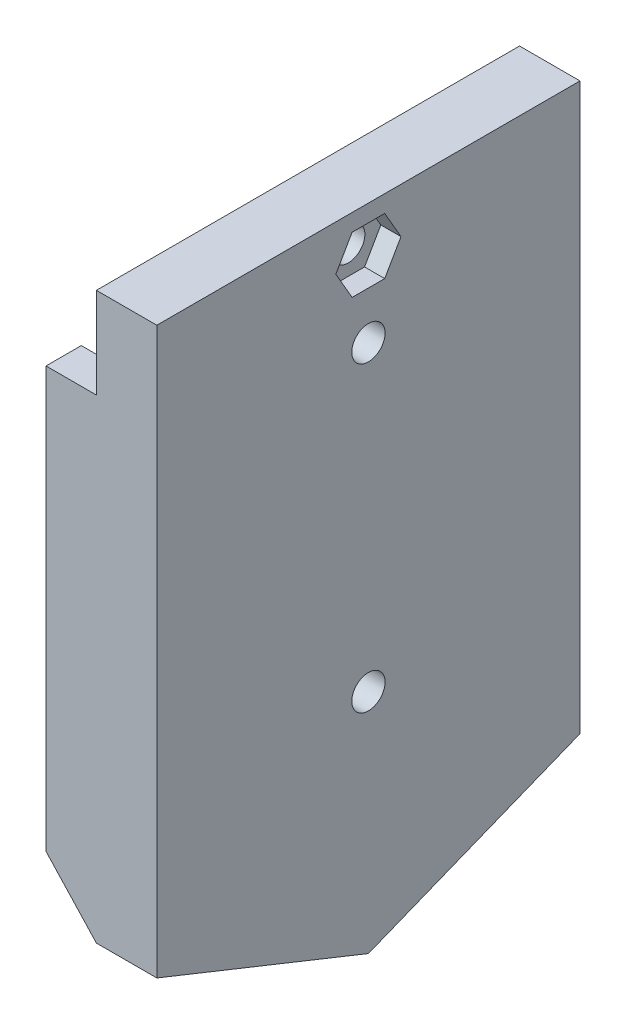
ISO-10303-21;
HEADER;
FILE_DESCRIPTION(('STEP AP214'),'2;1');
FILE_NAME('part.step','',(''),(''),'','','');
FILE_SCHEMA(('AUTOMOTIVE_DESIGN { 1 0 10303 214 1 1 1 1 }'));
ENDSEC;
DATA;
#1=APPLICATION_CONTEXT('core data for automotive mechanical design processes');
#2=APPLICATION_PROTOCOL_DEFINITION('international standard','automotive_design',2000,#1);
#3=PRODUCT_CONTEXT('',#1,'mechanical');
#4=PRODUCT('Part','Part','',(#3));
#5=PRODUCT_RELATED_PRODUCT_CATEGORY('part','',(#4));
#6=PRODUCT_DEFINITION_FORMATION('','',#4);
#7=PRODUCT_DEFINITION_CONTEXT('part definition',#1,'design');
#8=PRODUCT_DEFINITION('design','',#6,#7);
#9=PRODUCT_DEFINITION_SHAPE('','',#8);
#10=(LENGTH_UNIT() NAMED_UNIT(*) SI_UNIT(.MILLI.,.METRE.));
#11=(NAMED_UNIT(*) PLANE_ANGLE_UNIT() SI_UNIT($,.RADIAN.));
#12=(NAMED_UNIT(*) SI_UNIT($,.STERADIAN.) SOLID_ANGLE_UNIT());
#13=UNCERTAINTY_MEASURE_WITH_UNIT(LENGTH_MEASURE(1.E-05),#10,'distance_accuracy_value','');
#14=(GEOMETRIC_REPRESENTATION_CONTEXT(3) GLOBAL_UNCERTAINTY_ASSIGNED_CONTEXT((#13)) GLOBAL_UNIT_ASSIGNED_CONTEXT((#10,
#11,#12)) REPRESENTATION_CONTEXT('',''));
#15=CARTESIAN_POINT('',(0.,0.,0.));
#16=DIRECTION('',(0.,0.,1.));
#17=DIRECTION('',(1.,0.,0.));
#18=AXIS2_PLACEMENT_3D('',#15,#16,#17);
#19=CARTESIAN_POINT('',(6.00000000000001,-9.5,0.));
#20=DIRECTION('',(-1.,0.,0.));
#21=DIRECTION('',(0.,0.,1.));
#22=AXIS2_PLACEMENT_3D('',#19,#20,#21);
#23=CYLINDRICAL_SURFACE('',#22,1.65);
#24=CARTESIAN_POINT('',(6.00000000000001,-9.5,0.));
#25=DIRECTION('',(-1.,0.,0.));
#26=DIRECTION('',(0.,0.,1.));
#27=AXIS2_PLACEMENT_3D('',#24,#25,#26);
#28=CIRCLE('',#27,1.65);
#29=CARTESIAN_POINT('',(6.00000000000001,-9.5,1.65));
#30=VERTEX_POINT('',#29);
#31=EDGE_CURVE('E265',#30,#30,#28,.T.);
#32=ORIENTED_EDGE('',*,*,#31,.F.);
#33=EDGE_LOOP('',(#32));
#34=FACE_BOUND('',#33,.T.);
#35=CARTESIAN_POINT('',(2.5,-9.5,0.));
#36=DIRECTION('',(-1.,0.,0.));
#37=DIRECTION('',(0.,0.,1.));
#38=AXIS2_PLACEMENT_3D('',#35,#36,#37);
#39=CIRCLE('',#38,1.65);
#40=CARTESIAN_POINT('',(2.5,-9.5,1.65));
#41=VERTEX_POINT('',#40);
#42=EDGE_CURVE('E39',#41,#41,#39,.F.);
#43=ORIENTED_EDGE('',*,*,#42,.F.);
#44=EDGE_LOOP('',(#43));
#45=FACE_BOUND('',#44,.T.);
#46=ADVANCED_FACE('F35',(#34,#45),#23,.F.);
#47=CARTESIAN_POINT('',(6.00000000000001,20.5,0.));
#48=DIRECTION('',(-1.,0.,0.));
#49=DIRECTION('',(0.,0.,1.));
#50=AXIS2_PLACEMENT_3D('',#47,#48,#49);
#51=CYLINDRICAL_SURFACE('',#50,1.65);
#52=CARTESIAN_POINT('',(6.00000000000001,20.5,0.));
#53=DIRECTION('',(-1.,0.,0.));
#54=DIRECTION('',(0.,0.,1.));
#55=AXIS2_PLACEMENT_3D('',#52,#53,#54);
#56=CIRCLE('',#55,1.65);
#57=CARTESIAN_POINT('',(6.00000000000001,20.5,1.65));
#58=VERTEX_POINT('',#57);
#59=EDGE_CURVE('E328',#58,#58,#56,.T.);
#60=ORIENTED_EDGE('',*,*,#59,.F.);
#61=EDGE_LOOP('',(#60));
#62=FACE_BOUND('',#61,.T.);
#63=CARTESIAN_POINT('',(2.5,20.5,0.));
#64=DIRECTION('',(-1.,0.,0.));
#65=DIRECTION('',(0.,0.,1.));
#66=AXIS2_PLACEMENT_3D('',#63,#64,#65);
#67=CIRCLE('',#66,1.65);
#68=CARTESIAN_POINT('',(2.5,20.5,1.65));
#69=VERTEX_POINT('',#68);
#70=EDGE_CURVE('E267',#69,#69,#67,.F.);
#71=ORIENTED_EDGE('',*,*,#70,.F.);
#72=EDGE_LOOP('',(#71));
#73=FACE_BOUND('',#72,.T.);
#74=ADVANCED_FACE('F439',(#62,#73),#51,.F.);
#75=CARTESIAN_POINT('',(6.00000000000001,28.,0.));
#76=DIRECTION('',(-1.,0.,0.));
#77=DIRECTION('',(0.,0.,1.));
#78=AXIS2_PLACEMENT_3D('',#75,#76,#77);
#79=CYLINDRICAL_SURFACE('',#78,1.65);
#80=CARTESIAN_POINT('',(0.,28.,0.));
#81=DIRECTION('',(1.,0.,0.));
#82=DIRECTION('',(0.,0.,-1.));
#83=AXIS2_PLACEMENT_3D('',#80,#81,#82);
#84=CIRCLE('',#83,1.65);
#85=CARTESIAN_POINT('',(0.,28.,-1.65));
#86=VERTEX_POINT('',#85);
#87=EDGE_CURVE('E262',#86,#86,#84,.T.);
#88=ORIENTED_EDGE('',*,*,#87,.F.);
#89=EDGE_LOOP('',(#88));
#90=FACE_BOUND('',#89,.T.);
#91=CARTESIAN_POINT('',(4.00000000000001,28.,0.));
#92=DIRECTION('',(1.,0.,0.));
#93=DIRECTION('',(0.,0.,-1.));
#94=AXIS2_PLACEMENT_3D('',#91,#92,#93);
#95=CIRCLE('',#94,1.65);
#96=CARTESIAN_POINT('',(4.00000000000001,28.,-1.65));
#97=VERTEX_POINT('',#96);
#98=EDGE_CURVE('E263',#97,#97,#95,.F.);
#99=ORIENTED_EDGE('',*,*,#98,.F.);
#100=EDGE_LOOP('',(#99));
#101=FACE_BOUND('',#100,.T.);
#102=ADVANCED_FACE('F445',(#90,#101),#79,.F.);
#103=CARTESIAN_POINT('',(-5.,-16.5,0.));
#104=DIRECTION('',(0.,-0.928476690885259,0.371390676354104));
#105=DIRECTION('',(0.,-0.371390676354104,-0.928476690885259));
#106=AXIS2_PLACEMENT_3D('',#103,#104,#105);
#107=PLANE('',#106);
#108=DIRECTION('',(0.,0.371390676354104,0.928476690885259));
#109=VECTOR('',#108,1.);
#110=CARTESIAN_POINT('',(-4.,-16.5,0.));
#111=LINE('',#110,#109);
#112=CARTESIAN_POINT('',(-4.,-16.5,0.));
#113=VERTEX_POINT('',#112);
#114=CARTESIAN_POINT('',(-4.,-9.5,17.5));
#115=VERTEX_POINT('',#114);
#116=EDGE_CURVE('E337',#113,#115,#111,.T.);
#117=ORIENTED_EDGE('',*,*,#116,.F.);
#118=DIRECTION('',(1.,0.,0.));
#119=VECTOR('',#118,1.);
#120=CARTESIAN_POINT('',(-5.,-16.5,0.));
#121=LINE('',#120,#119);
#122=CARTESIAN_POINT('',(-5.,-16.5,0.));
#123=VERTEX_POINT('',#122);
#124=EDGE_CURVE('E224',#123,#113,#121,.T.);
#125=ORIENTED_EDGE('',*,*,#124,.F.);
#126=DIRECTION('',(0.,-0.371390676354104,-0.928476690885259));
#127=VECTOR('',#126,1.);
#128=CARTESIAN_POINT('',(-5.,-16.5,0.));
#129=LINE('',#128,#127);
#130=CARTESIAN_POINT('',(-5.,-9.5,17.5));
#131=VERTEX_POINT('',#130);
#132=EDGE_CURVE('E343',#131,#123,#129,.T.);
#133=ORIENTED_EDGE('',*,*,#132,.F.);
#134=DIRECTION('',(1.,0.,0.));
#135=VECTOR('',#134,1.);
#136=CARTESIAN_POINT('',(-5.,-9.5,17.5));
#137=LINE('',#136,#135);
#138=EDGE_CURVE('E360',#131,#115,#137,.T.);
#139=ORIENTED_EDGE('',*,*,#138,.T.);
#140=EDGE_LOOP('',(#117,#125,#133,#139));
#141=FACE_BOUND('',#140,.T.);
#142=ADVANCED_FACE('F453',(#141),#107,.F.);
#143=CARTESIAN_POINT('',(-5.,-9.5,-17.5));
#144=DIRECTION('',(0.,-0.928476690885259,-0.371390676354104));
#145=DIRECTION('',(0.,0.371390676354104,-0.928476690885259));
#146=AXIS2_PLACEMENT_3D('',#143,#144,#145);
#147=PLANE('',#146);
#148=DIRECTION('',(0.,-0.371390676354104,0.928476690885259));
#149=VECTOR('',#148,1.);
#150=CARTESIAN_POINT('',(-4.,-9.5,-17.5));
#151=LINE('',#150,#149);
#152=CARTESIAN_POINT('',(-4.,-9.5,-17.5));
#153=VERTEX_POINT('',#152);
#154=EDGE_CURVE('E230',#153,#113,#151,.T.);
#155=ORIENTED_EDGE('',*,*,#154,.F.);
#156=DIRECTION('',(1.,0.,0.));
#157=VECTOR('',#156,1.);
#158=CARTESIAN_POINT('',(-5.,-9.5,-17.5));
#159=LINE('',#158,#157);
#160=CARTESIAN_POINT('',(-5.,-9.5,-17.5));
#161=VERTEX_POINT('',#160);
#162=EDGE_CURVE('E384',#161,#153,#159,.T.);
#163=ORIENTED_EDGE('',*,*,#162,.F.);
#164=DIRECTION('',(0.,0.371390676354104,-0.928476690885259));
#165=VECTOR('',#164,1.);
#166=CARTESIAN_POINT('',(-5.,-9.5,-17.5));
#167=LINE('',#166,#165);
#168=EDGE_CURVE('E346',#123,#161,#167,.T.);
#169=ORIENTED_EDGE('',*,*,#168,.F.);
#170=ORIENTED_EDGE('',*,*,#124,.T.);
#171=EDGE_LOOP('',(#155,#163,#169,#170));
#172=FACE_BOUND('',#171,.T.);
#173=ADVANCED_FACE('F474',(#172),#147,.F.);
#174=CARTESIAN_POINT('',(0.,32.5,21.));
#175=DIRECTION('',(1.,0.,0.));
#176=DIRECTION('',(0.,0.,-1.));
#177=AXIS2_PLACEMENT_3D('',#174,#175,#176);
#178=PLANE('',#177);
#179=CARTESIAN_POINT('',(0.,-9.5,0.));
#180=DIRECTION('',(-1.,0.,0.));
#181=DIRECTION('',(0.,0.,1.));
#182=AXIS2_PLACEMENT_3D('',#179,#180,#181);
#183=CIRCLE('',#182,3.5);
#184=CARTESIAN_POINT('',(0.,-9.5,3.5));
#185=VERTEX_POINT('',#184);
#186=EDGE_CURVE('E282',#185,#185,#183,.T.);
#187=ORIENTED_EDGE('',*,*,#186,.F.);
#188=EDGE_LOOP('',(#187));
#189=FACE_BOUND('',#188,.T.);
#190=CARTESIAN_POINT('',(0.,20.5,0.));
#191=DIRECTION('',(-1.,0.,0.));
#192=DIRECTION('',(0.,0.,1.));
#193=AXIS2_PLACEMENT_3D('',#190,#191,#192);
#194=CIRCLE('',#193,3.5);
#195=CARTESIAN_POINT('',(0.,20.5,3.5));
#196=VERTEX_POINT('',#195);
#197=EDGE_CURVE('E275',#196,#196,#194,.T.);
#198=ORIENTED_EDGE('',*,*,#197,.F.);
#199=EDGE_LOOP('',(#198));
#200=FACE_BOUND('',#199,.T.);
#201=ORIENTED_EDGE('',*,*,#87,.T.);
#202=EDGE_LOOP('',(#201));
#203=FACE_BOUND('',#202,.T.);
#204=DIRECTION('',(0.,1.,0.));
#205=VECTOR('',#204,1.);
#206=CARTESIAN_POINT('',(0.,23.5,-17.5));
#207=LINE('',#206,#205);
#208=CARTESIAN_POINT('',(0.,-13.9151208925754,-17.5));
#209=VERTEX_POINT('',#208);
#210=CARTESIAN_POINT('',(0.,23.5,-17.5));
#211=VERTEX_POINT('',#210);
#212=EDGE_CURVE('E342',#209,#211,#207,.T.);
#213=ORIENTED_EDGE('',*,*,#212,.F.);
#214=DIRECTION('',(0.,-0.371390676354104,0.928476690885259));
#215=VECTOR('',#214,1.);
#216=CARTESIAN_POINT('',(0.,-21.2716559418753,0.891337623249878));
#217=LINE('',#216,#215);
#218=CARTESIAN_POINT('',(0.,-20.9151208925754,0.));
#219=VERTEX_POINT('',#218);
#220=EDGE_CURVE('E234',#209,#219,#217,.T.);
#221=ORIENTED_EDGE('',*,*,#220,.T.);
#222=DIRECTION('',(0.,0.371390676354104,0.92847669088526));
#223=VECTOR('',#222,1.);
#224=CARTESIAN_POINT('',(0.,-14.2716559418753,16.6086623767501));
#225=LINE('',#224,#223);
#226=CARTESIAN_POINT('',(0.,-13.9151208925754,17.5));
#227=VERTEX_POINT('',#226);
#228=EDGE_CURVE('E232',#219,#227,#225,.T.);
#229=ORIENTED_EDGE('',*,*,#228,.T.);
#230=DIRECTION('',(0.,-1.,0.));
#231=VECTOR('',#230,1.);
#232=CARTESIAN_POINT('',(0.,23.5,17.5));
#233=LINE('',#232,#231);
#234=CARTESIAN_POINT('',(0.,23.5,17.5));
#235=VERTEX_POINT('',#234);
#236=EDGE_CURVE('E347',#235,#227,#233,.T.);
#237=ORIENTED_EDGE('',*,*,#236,.F.);
#238=DIRECTION('',(0.,0.,-1.));
#239=VECTOR('',#238,1.);
#240=CARTESIAN_POINT('',(0.,23.5,17.5));
#241=LINE('',#240,#239);
#242=CARTESIAN_POINT('',(0.,23.5,21.));
#243=VERTEX_POINT('',#242);
#244=EDGE_CURVE('E365',#243,#235,#241,.T.);
#245=ORIENTED_EDGE('',*,*,#244,.F.);
#246=DIRECTION('',(0.,-1.,0.));
#247=VECTOR('',#246,1.);
#248=CARTESIAN_POINT('',(0.,32.5,21.));
#249=LINE('',#248,#247);
#250=CARTESIAN_POINT('',(0.,32.5,21.));
#251=VERTEX_POINT('',#250);
#252=EDGE_CURVE('E211',#251,#243,#249,.T.);
#253=ORIENTED_EDGE('',*,*,#252,.F.);
#254=DIRECTION('',(0.,0.,-1.));
#255=VECTOR('',#254,1.);
#256=CARTESIAN_POINT('',(0.,32.5,21.));
#257=LINE('',#256,#255);
#258=CARTESIAN_POINT('',(0.,32.5,-21.));
#259=VERTEX_POINT('',#258);
#260=EDGE_CURVE('E213',#251,#259,#257,.T.);
#261=ORIENTED_EDGE('',*,*,#260,.T.);
#262=DIRECTION('',(0.,-1.,0.));
#263=VECTOR('',#262,1.);
#264=CARTESIAN_POINT('',(0.,32.5,-21.));
#265=LINE('',#264,#263);
#266=CARTESIAN_POINT('',(0.,23.5,-21.));
#267=VERTEX_POINT('',#266);
#268=EDGE_CURVE('E223',#259,#267,#265,.T.);
#269=ORIENTED_EDGE('',*,*,#268,.T.);
#270=DIRECTION('',(0.,0.,-1.));
#271=VECTOR('',#270,1.);
#272=CARTESIAN_POINT('',(0.,23.5,-21.));
#273=LINE('',#272,#271);
#274=EDGE_CURVE('E362',#211,#267,#273,.T.);
#275=ORIENTED_EDGE('',*,*,#274,.F.);
#276=EDGE_LOOP('',(#213,#221,#229,#237,#245,#253,#261,#269,#275));
#277=FACE_BOUND('',#276,.T.);
#278=ADVANCED_FACE('F394',(#189,#200,#203,#277),#178,.F.);
#279=CARTESIAN_POINT('',(6.00000000000001,32.5,21.));
#280=DIRECTION('',(0.,-1.,0.));
#281=DIRECTION('',(0.,0.,-1.));
#282=AXIS2_PLACEMENT_3D('',#279,#280,#281);
#283=PLANE('',#282);
#284=DIRECTION('',(-1.,0.,0.));
#285=VECTOR('',#284,1.);
#286=CARTESIAN_POINT('',(6.00000000000001,32.5,-21.));
#287=LINE('',#286,#285);
#288=CARTESIAN_POINT('',(6.00000000000001,32.5,-21.));
#289=VERTEX_POINT('',#288);
#290=EDGE_CURVE('E220',#289,#259,#287,.T.);
#291=ORIENTED_EDGE('',*,*,#290,.T.);
#292=ORIENTED_EDGE('',*,*,#260,.F.);
#293=DIRECTION('',(-1.,0.,0.));
#294=VECTOR('',#293,1.);
#295=CARTESIAN_POINT('',(6.00000000000001,32.5,21.));
#296=LINE('',#295,#294);
#297=CARTESIAN_POINT('',(6.00000000000001,32.5,21.));
#298=VERTEX_POINT('',#297);
#299=EDGE_CURVE('E216',#298,#251,#296,.T.);
#300=ORIENTED_EDGE('',*,*,#299,.F.);
#301=DIRECTION('',(0.,0.,-1.));
#302=VECTOR('',#301,1.);
#303=CARTESIAN_POINT('',(6.00000000000001,32.5,21.));
#304=LINE('',#303,#302);
#305=EDGE_CURVE('E209',#298,#289,#304,.T.);
#306=ORIENTED_EDGE('',*,*,#305,.T.);
#307=EDGE_LOOP('',(#291,#292,#300,#306));
#308=FACE_BOUND('',#307,.T.);
#309=ADVANCED_FACE('F390',(#308),#283,.F.);
#310=CARTESIAN_POINT('',(6.00000000000001,-32.5,21.));
#311=DIRECTION('',(-1.,0.,0.));
#312=DIRECTION('',(0.,0.,1.));
#313=AXIS2_PLACEMENT_3D('',#310,#311,#312);
#314=PLANE('',#313);
#315=DIRECTION('',(0.,0.866025403784438,0.500000000000001));
#316=VECTOR('',#315,1.);
#317=CARTESIAN_POINT('',(6.00000000000001,28.,-3.2331615074619));
#318=LINE('',#317,#316);
#319=CARTESIAN_POINT('',(6.00000000000001,28.,-3.23316150746191));
#320=VERTEX_POINT('',#319);
#321=CARTESIAN_POINT('',(6.00000000000001,30.8,-1.61658075373095));
#322=VERTEX_POINT('',#321);
#323=EDGE_CURVE('E272',#320,#322,#318,.T.);
#324=ORIENTED_EDGE('',*,*,#323,.F.);
#325=DIRECTION('',(0.,0.866025403784439,-0.499999999999999));
#326=VECTOR('',#325,1.);
#327=CARTESIAN_POINT('',(6.00000000000001,25.2,-1.61658075373095));
#328=LINE('',#327,#326);
#329=CARTESIAN_POINT('',(6.00000000000001,25.2,-1.61658075373095));
#330=VERTEX_POINT('',#329);
#331=EDGE_CURVE('E52',#330,#320,#328,.T.);
#332=ORIENTED_EDGE('',*,*,#331,.F.);
#333=DIRECTION('',(0.,0.,-1.));
#334=VECTOR('',#333,1.);
#335=CARTESIAN_POINT('',(6.00000000000001,25.2,1.61658075373095));
#336=LINE('',#335,#334);
#337=CARTESIAN_POINT('',(6.00000000000001,25.2,1.61658075373095));
#338=VERTEX_POINT('',#337);
#339=EDGE_CURVE('E289',#338,#330,#336,.T.);
#340=ORIENTED_EDGE('',*,*,#339,.F.);
#341=DIRECTION('',(0.,-0.866025403784439,-0.5));
#342=VECTOR('',#341,1.);
#343=CARTESIAN_POINT('',(6.00000000000001,28.,3.23316150746191));
#344=LINE('',#343,#342);
#345=CARTESIAN_POINT('',(6.00000000000001,28.,3.23316150746191));
#346=VERTEX_POINT('',#345);
#347=EDGE_CURVE('E313',#346,#338,#344,.T.);
#348=ORIENTED_EDGE('',*,*,#347,.F.);
#349=DIRECTION('',(0.,-0.866025403784439,0.5));
#350=VECTOR('',#349,1.);
#351=CARTESIAN_POINT('',(6.00000000000001,30.8,1.61658075373095));
#352=LINE('',#351,#350);
#353=CARTESIAN_POINT('',(6.00000000000001,30.8,1.61658075373095));
#354=VERTEX_POINT('',#353);
#355=EDGE_CURVE('E310',#354,#346,#352,.T.);
#356=ORIENTED_EDGE('',*,*,#355,.F.);
#357=DIRECTION('',(0.,0.,1.));
#358=VECTOR('',#357,1.);
#359=CARTESIAN_POINT('',(6.00000000000001,30.8,-1.61658075373095));
#360=LINE('',#359,#358);
#361=EDGE_CURVE('E307',#322,#354,#360,.T.);
#362=ORIENTED_EDGE('',*,*,#361,.F.);
#363=EDGE_LOOP('',(#324,#332,#340,#348,#356,#362));
#364=FACE_BOUND('',#363,.T.);
#365=ORIENTED_EDGE('',*,*,#59,.T.);
#366=EDGE_LOOP('',(#365));
#367=FACE_BOUND('',#366,.T.);
#368=ORIENTED_EDGE('',*,*,#31,.T.);
#369=EDGE_LOOP('',(#368));
#370=FACE_BOUND('',#369,.T.);
#371=DIRECTION('',(0.,-0.371390676354104,-0.928476690885259));
#372=VECTOR('',#371,1.);
#373=CARTESIAN_POINT('',(6.00000000000001,-23.6092746445474,21.));
#374=LINE('',#373,#372);
#375=CARTESIAN_POINT('',(6.00000000000001,-23.6092746445474,21.));
#376=VERTEX_POINT('',#375);
#377=CARTESIAN_POINT('',(6.00000000000001,-32.0092746445474,0.));
#378=VERTEX_POINT('',#377);
#379=EDGE_CURVE('E188',#376,#378,#374,.T.);
#380=ORIENTED_EDGE('',*,*,#379,.T.);
#381=DIRECTION('',(0.,0.371390676354103,-0.928476690885259));
#382=VECTOR('',#381,1.);
#383=CARTESIAN_POINT('',(6.00000000000001,-32.0092746445474,0.));
#384=LINE('',#383,#382);
#385=CARTESIAN_POINT('',(6.00000000000001,-23.6092746445474,-21.));
#386=VERTEX_POINT('',#385);
#387=EDGE_CURVE('E198',#378,#386,#384,.T.);
#388=ORIENTED_EDGE('',*,*,#387,.T.);
#389=DIRECTION('',(0.,1.,0.));
#390=VECTOR('',#389,1.);
#391=CARTESIAN_POINT('',(6.00000000000001,-32.5,-21.));
#392=LINE('',#391,#390);
#393=EDGE_CURVE('E226',#386,#289,#392,.T.);
#394=ORIENTED_EDGE('',*,*,#393,.T.);
#395=ORIENTED_EDGE('',*,*,#305,.F.);
#396=DIRECTION('',(0.,1.,0.));
#397=VECTOR('',#396,1.);
#398=CARTESIAN_POINT('',(6.00000000000001,-32.5,21.));
#399=LINE('',#398,#397);
#400=EDGE_CURVE('E202',#376,#298,#399,.T.);
#401=ORIENTED_EDGE('',*,*,#400,.F.);
#402=EDGE_LOOP('',(#380,#388,#394,#395,#401));
#403=FACE_BOUND('',#402,.T.);
#404=ADVANCED_FACE('F207',(#364,#367,#370,#403),#314,.F.);
#405=CARTESIAN_POINT('',(0.,0.,21.));
#406=DIRECTION('',(0.,0.,1.));
#407=DIRECTION('',(1.,0.,0.));
#408=AXIS2_PLACEMENT_3D('',#405,#406,#407);
#409=PLANE('',#408);
#410=DIRECTION('',(-1.,0.,0.));
#411=VECTOR('',#410,1.);
#412=CARTESIAN_POINT('',(6.00000000000001,-23.6092746445474,21.));
#413=LINE('',#412,#411);
#414=CARTESIAN_POINT('',(0.,-23.6092746445474,21.));
#415=VERTEX_POINT('',#414);
#416=EDGE_CURVE('E191',#376,#415,#413,.T.);
#417=ORIENTED_EDGE('',*,*,#416,.F.);
#418=ORIENTED_EDGE('',*,*,#400,.T.);
#419=ORIENTED_EDGE('',*,*,#299,.T.);
#420=ORIENTED_EDGE('',*,*,#252,.T.);
#421=DIRECTION('',(1.,0.,0.));
#422=VECTOR('',#421,1.);
#423=CARTESIAN_POINT('',(-5.,23.5,21.));
#424=LINE('',#423,#422);
#425=CARTESIAN_POINT('',(-5.,23.5,21.));
#426=VERTEX_POINT('',#425);
#427=EDGE_CURVE('E375',#426,#243,#424,.T.);
#428=ORIENTED_EDGE('',*,*,#427,.F.);
#429=DIRECTION('',(0.,1.,0.));
#430=VECTOR('',#429,1.);
#431=CARTESIAN_POINT('',(-5.,23.5,21.));
#432=LINE('',#431,#430);
#433=CARTESIAN_POINT('',(-5.,-18.224109837413,21.));
#434=VERTEX_POINT('',#433);
#435=EDGE_CURVE('E60',#434,#426,#432,.T.);
#436=ORIENTED_EDGE('',*,*,#435,.F.);
#437=DIRECTION('',(-0.680413817439775,0.732828108792937,0.));
#438=VECTOR('',#437,1.);
#439=CARTESIAN_POINT('',(-6.4000000000001,-16.7162636914152,21.));
#440=LINE('',#439,#438);
#441=EDGE_CURVE('E11',#434,#415,#440,.F.);
#442=ORIENTED_EDGE('',*,*,#441,.T.);
#443=EDGE_LOOP('',(#417,#418,#419,#420,#428,#436,#442));
#444=FACE_BOUND('',#443,.T.);
#445=ADVANCED_FACE('F200',(#444),#409,.T.);
#446=CARTESIAN_POINT('',(0.,0.,-21.));
#447=DIRECTION('',(0.,0.,1.));
#448=DIRECTION('',(1.,0.,0.));
#449=AXIS2_PLACEMENT_3D('',#446,#447,#448);
#450=PLANE('',#449);
#451=ORIENTED_EDGE('',*,*,#393,.F.);
#452=DIRECTION('',(-1.,0.,0.));
#453=VECTOR('',#452,1.);
#454=CARTESIAN_POINT('',(6.00000000000001,-23.6092746445474,-21.));
#455=LINE('',#454,#453);
#456=CARTESIAN_POINT('',(0.,-23.6092746445474,-21.));
#457=VERTEX_POINT('',#456);
#458=EDGE_CURVE('E417',#386,#457,#455,.T.);
#459=ORIENTED_EDGE('',*,*,#458,.T.);
#460=DIRECTION('',(0.680413817439775,-0.732828108792936,0.));
#461=VECTOR('',#460,1.);
#462=CARTESIAN_POINT('',(-11.7722069386842,-10.9302197428461,-21.));
#463=LINE('',#462,#461);
#464=CARTESIAN_POINT('',(-5.,-18.224109837413,-21.));
#465=VERTEX_POINT('',#464);
#466=EDGE_CURVE('E256',#457,#465,#463,.F.);
#467=ORIENTED_EDGE('',*,*,#466,.T.);
#468=DIRECTION('',(0.,-1.,0.));
#469=VECTOR('',#468,1.);
#470=CARTESIAN_POINT('',(-5.,-16.7162636914152,-21.));
#471=LINE('',#470,#469);
#472=CARTESIAN_POINT('',(-5.,23.5,-21.));
#473=VERTEX_POINT('',#472);
#474=EDGE_CURVE('E353',#473,#465,#471,.T.);
#475=ORIENTED_EDGE('',*,*,#474,.F.);
#476=DIRECTION('',(1.,0.,0.));
#477=VECTOR('',#476,1.);
#478=CARTESIAN_POINT('',(-5.,23.5,-21.));
#479=LINE('',#478,#477);
#480=EDGE_CURVE('E378',#473,#267,#479,.T.);
#481=ORIENTED_EDGE('',*,*,#480,.T.);
#482=ORIENTED_EDGE('',*,*,#268,.F.);
#483=ORIENTED_EDGE('',*,*,#290,.F.);
#484=EDGE_LOOP('',(#451,#459,#467,#475,#481,#482,#483));
#485=FACE_BOUND('',#484,.T.);
#486=ADVANCED_FACE('F425',(#485),#450,.F.);
#487=CARTESIAN_POINT('',(-5.,23.5,-17.5));
#488=DIRECTION('',(0.,0.,-1.));
#489=DIRECTION('',(0.,1.,0.));
#490=AXIS2_PLACEMENT_3D('',#487,#488,#489);
#491=PLANE('',#490);
#492=DIRECTION('',(0.,-1.,0.));
#493=VECTOR('',#492,1.);
#494=CARTESIAN_POINT('',(-4.,-16.5,-17.5));
#495=LINE('',#494,#493);
#496=CARTESIAN_POINT('',(-4.,-9.60698904686779,-17.5));
#497=VERTEX_POINT('',#496);
#498=EDGE_CURVE('E249',#153,#497,#495,.T.);
#499=ORIENTED_EDGE('',*,*,#498,.T.);
#500=DIRECTION('',(0.680413817439775,-0.732828108792936,0.));
#501=VECTOR('',#500,1.);
#502=CARTESIAN_POINT('',(5.89038459721693,-20.2592592592592,-17.5));
#503=LINE('',#502,#501);
#504=EDGE_CURVE('E241',#497,#209,#503,.T.);
#505=ORIENTED_EDGE('',*,*,#504,.T.);
#506=ORIENTED_EDGE('',*,*,#212,.T.);
#507=DIRECTION('',(1.,0.,0.));
#508=VECTOR('',#507,1.);
#509=CARTESIAN_POINT('',(-5.,23.5,-17.5));
#510=LINE('',#509,#508);
#511=CARTESIAN_POINT('',(-5.,23.5,-17.5));
#512=VERTEX_POINT('',#511);
#513=EDGE_CURVE('E381',#512,#211,#510,.T.);
#514=ORIENTED_EDGE('',*,*,#513,.F.);
#515=DIRECTION('',(0.,1.,0.));
#516=VECTOR('',#515,1.);
#517=CARTESIAN_POINT('',(-5.,23.5,-17.5));
#518=LINE('',#517,#516);
#519=EDGE_CURVE('E349',#161,#512,#518,.T.);
#520=ORIENTED_EDGE('',*,*,#519,.F.);
#521=ORIENTED_EDGE('',*,*,#162,.T.);
#522=EDGE_LOOP('',(#499,#505,#506,#514,#520,#521));
#523=FACE_BOUND('',#522,.T.);
#524=ADVANCED_FACE('F469',(#523),#491,.F.);
#525=CARTESIAN_POINT('',(-5.,23.5,-21.));
#526=DIRECTION('',(0.,-1.,0.));
#527=DIRECTION('',(0.,0.,-1.));
#528=AXIS2_PLACEMENT_3D('',#525,#526,#527);
#529=PLANE('',#528);
#530=ORIENTED_EDGE('',*,*,#274,.T.);
#531=ORIENTED_EDGE('',*,*,#480,.F.);
#532=DIRECTION('',(0.,0.,-1.));
#533=VECTOR('',#532,1.);
#534=CARTESIAN_POINT('',(-5.,23.5,-21.));
#535=LINE('',#534,#533);
#536=EDGE_CURVE('E351',#512,#473,#535,.T.);
#537=ORIENTED_EDGE('',*,*,#536,.F.);
#538=ORIENTED_EDGE('',*,*,#513,.T.);
#539=EDGE_LOOP('',(#530,#531,#537,#538));
#540=FACE_BOUND('',#539,.T.);
#541=ADVANCED_FACE('F466',(#540),#529,.F.);
#542=CARTESIAN_POINT('',(-5.,23.5,17.5));
#543=DIRECTION('',(0.,-1.,0.));
#544=DIRECTION('',(0.,0.,-1.));
#545=AXIS2_PLACEMENT_3D('',#542,#543,#544);
#546=PLANE('',#545);
#547=ORIENTED_EDGE('',*,*,#244,.T.);
#548=DIRECTION('',(1.,0.,0.));
#549=VECTOR('',#548,1.);
#550=CARTESIAN_POINT('',(-5.,23.5,17.5));
#551=LINE('',#550,#549);
#552=CARTESIAN_POINT('',(-5.,23.5,17.5));
#553=VERTEX_POINT('',#552);
#554=EDGE_CURVE('E372',#553,#235,#551,.T.);
#555=ORIENTED_EDGE('',*,*,#554,.F.);
#556=DIRECTION('',(0.,0.,-1.));
#557=VECTOR('',#556,1.);
#558=CARTESIAN_POINT('',(-5.,23.5,17.5));
#559=LINE('',#558,#557);
#560=EDGE_CURVE('E356',#426,#553,#559,.T.);
#561=ORIENTED_EDGE('',*,*,#560,.F.);
#562=ORIENTED_EDGE('',*,*,#427,.T.);
#563=EDGE_LOOP('',(#547,#555,#561,#562));
#564=FACE_BOUND('',#563,.T.);
#565=ADVANCED_FACE('F398',(#564),#546,.F.);
#566=CARTESIAN_POINT('',(-5.,23.5,17.5));
#567=DIRECTION('',(0.,0.,1.));
#568=DIRECTION('',(0.,-1.,0.));
#569=AXIS2_PLACEMENT_3D('',#566,#567,#568);
#570=PLANE('',#569);
#571=ORIENTED_EDGE('',*,*,#236,.T.);
#572=DIRECTION('',(-0.680413817439775,0.732828108792936,0.));
#573=VECTOR('',#572,1.);
#574=CARTESIAN_POINT('',(2.40000000000011,-16.5,17.5));
#575=LINE('',#574,#573);
#576=CARTESIAN_POINT('',(-4.,-9.60698904686779,17.5));
#577=VERTEX_POINT('',#576);
#578=EDGE_CURVE('E243',#227,#577,#575,.T.);
#579=ORIENTED_EDGE('',*,*,#578,.T.);
#580=DIRECTION('',(0.,1.,0.));
#581=VECTOR('',#580,1.);
#582=CARTESIAN_POINT('',(-4.,-9.5,17.5));
#583=LINE('',#582,#581);
#584=EDGE_CURVE('E335',#577,#115,#583,.T.);
#585=ORIENTED_EDGE('',*,*,#584,.T.);
#586=ORIENTED_EDGE('',*,*,#138,.F.);
#587=DIRECTION('',(0.,-1.,0.));
#588=VECTOR('',#587,1.);
#589=CARTESIAN_POINT('',(-5.,23.5,17.5));
#590=LINE('',#589,#588);
#591=EDGE_CURVE('E358',#553,#131,#590,.T.);
#592=ORIENTED_EDGE('',*,*,#591,.F.);
#593=ORIENTED_EDGE('',*,*,#554,.T.);
#594=EDGE_LOOP('',(#571,#579,#585,#586,#592,#593));
#595=FACE_BOUND('',#594,.T.);
#596=ADVANCED_FACE('F402',(#595),#570,.F.);
#597=CARTESIAN_POINT('',(-5.,0.,0.));
#598=DIRECTION('',(1.,0.,0.));
#599=DIRECTION('',(0.,0.,-1.));
#600=AXIS2_PLACEMENT_3D('',#597,#598,#599);
#601=PLANE('',#600);
#602=ORIENTED_EDGE('',*,*,#132,.T.);
#603=ORIENTED_EDGE('',*,*,#168,.T.);
#604=ORIENTED_EDGE('',*,*,#519,.T.);
#605=ORIENTED_EDGE('',*,*,#536,.T.);
#606=ORIENTED_EDGE('',*,*,#474,.T.);
#607=DIRECTION('',(0.,0.371390676354104,-0.928476690885259));
#608=VECTOR('',#607,1.);
#609=CARTESIAN_POINT('',(-5.,-22.951818825356,-9.1807275301424));
#610=LINE('',#609,#608);
#611=CARTESIAN_POINT('',(-5.,-26.624109837413,0.));
#612=VERTEX_POINT('',#611);
#613=EDGE_CURVE('E254',#465,#612,#610,.F.);
#614=ORIENTED_EDGE('',*,*,#613,.T.);
#615=DIRECTION('',(0.,-0.371390676354104,-0.928476690885259));
#616=VECTOR('',#615,1.);
#617=CARTESIAN_POINT('',(-5.,-22.951818825356,9.18072753014241));
#618=LINE('',#617,#616);
#619=EDGE_CURVE('E44',#612,#434,#618,.F.);
#620=ORIENTED_EDGE('',*,*,#619,.T.);
#621=ORIENTED_EDGE('',*,*,#435,.T.);
#622=ORIENTED_EDGE('',*,*,#560,.T.);
#623=ORIENTED_EDGE('',*,*,#591,.T.);
#624=EDGE_LOOP('',(#602,#603,#604,#605,#606,#614,#620,#621,#622,#623));
#625=FACE_BOUND('',#624,.T.);
#626=ADVANCED_FACE('F407',(#625),#601,.F.);
#627=CARTESIAN_POINT('',(-4.,0.,0.));
#628=DIRECTION('',(1.,0.,0.));
#629=DIRECTION('',(0.,0.,-1.));
#630=AXIS2_PLACEMENT_3D('',#627,#628,#629);
#631=PLANE('',#630);
#632=DIRECTION('',(0.,-0.371390676354104,-0.928476690885259));
#633=VECTOR('',#632,1.);
#634=CARTESIAN_POINT('',(-4.,-14.3163698679895,5.72654794719579));
#635=LINE('',#634,#633);
#636=CARTESIAN_POINT('',(-4.,-16.6069890468678,0.));
#637=VERTEX_POINT('',#636);
#638=EDGE_CURVE('E236',#577,#637,#635,.T.);
#639=ORIENTED_EDGE('',*,*,#638,.T.);
#640=DIRECTION('',(0.,0.371390676354104,-0.928476690885259));
#641=VECTOR('',#640,1.);
#642=CARTESIAN_POINT('',(-4.,-14.3163698679895,-5.72654794719579));
#643=LINE('',#642,#641);
#644=EDGE_CURVE('E238',#637,#497,#643,.T.);
#645=ORIENTED_EDGE('',*,*,#644,.T.);
#646=ORIENTED_EDGE('',*,*,#498,.F.);
#647=ORIENTED_EDGE('',*,*,#154,.T.);
#648=ORIENTED_EDGE('',*,*,#116,.T.);
#649=ORIENTED_EDGE('',*,*,#584,.F.);
#650=EDGE_LOOP('',(#639,#645,#646,#647,#648,#649));
#651=FACE_BOUND('',#650,.T.);
#652=ADVANCED_FACE('F455',(#651),#631,.T.);
#653=CARTESIAN_POINT('',(2.40000000000011,-16.5,17.5));
#654=DIRECTION('',(-0.707106781186544,-0.656532164298616,0.262612865719446));
#655=DIRECTION('',(0.,0.371390676354104,0.928476690885259));
#656=AXIS2_PLACEMENT_3D('',#653,#654,#655);
#657=PLANE('',#656);
#658=ORIENTED_EDGE('',*,*,#578,.F.);
#659=ORIENTED_EDGE('',*,*,#228,.F.);
#660=DIRECTION('',(-0.680413817439776,0.732828108792936,0.));
#661=VECTOR('',#660,1.);
#662=CARTESIAN_POINT('',(2.40000000000011,-23.5,0.));
#663=LINE('',#662,#661);
#664=EDGE_CURVE('E246',#637,#219,#663,.F.);
#665=ORIENTED_EDGE('',*,*,#664,.F.);
#666=ORIENTED_EDGE('',*,*,#638,.F.);
#667=EDGE_LOOP('',(#658,#659,#665,#666));
#668=FACE_BOUND('',#667,.T.);
#669=ADVANCED_FACE('F458',(#668),#657,.F.);
#670=CARTESIAN_POINT('',(2.40000000000011,-23.5,0.));
#671=DIRECTION('',(-0.707106781186544,-0.656532164298616,-0.262612865719447));
#672=DIRECTION('',(0.,-0.371390676354104,0.928476690885259));
#673=AXIS2_PLACEMENT_3D('',#670,#671,#672);
#674=PLANE('',#673);
#675=ORIENTED_EDGE('',*,*,#504,.F.);
#676=ORIENTED_EDGE('',*,*,#644,.F.);
#677=ORIENTED_EDGE('',*,*,#664,.T.);
#678=ORIENTED_EDGE('',*,*,#220,.F.);
#679=EDGE_LOOP('',(#675,#676,#677,#678));
#680=FACE_BOUND('',#679,.T.);
#681=ADVANCED_FACE('F493',(#680),#674,.F.);
#682=CARTESIAN_POINT('',(-6.4000000000001,-16.7162636914152,21.));
#683=DIRECTION('',(-0.707106781186544,-0.656532164298616,0.262612865719446));
#684=DIRECTION('',(0.,-0.371390676354104,-0.928476690885259));
#685=AXIS2_PLACEMENT_3D('',#682,#683,#684);
#686=PLANE('',#685);
#687=ORIENTED_EDGE('',*,*,#441,.F.);
#688=ORIENTED_EDGE('',*,*,#619,.F.);
#689=DIRECTION('',(-0.680413817439775,0.732828108792937,0.));
#690=VECTOR('',#689,1.);
#691=CARTESIAN_POINT('',(-6.4000000000001,-25.1162636914152,0.));
#692=LINE('',#691,#690);
#693=CARTESIAN_POINT('',(0.,-32.0092746445474,0.));
#694=VERTEX_POINT('',#693);
#695=EDGE_CURVE('E250',#694,#612,#692,.T.);
#696=ORIENTED_EDGE('',*,*,#695,.F.);
#697=DIRECTION('',(0.,-0.371390676354104,-0.928476690885259));
#698=VECTOR('',#697,1.);
#699=CARTESIAN_POINT('',(0.,-31.0585145130809,2.37690032866628));
#700=LINE('',#699,#698);
#701=EDGE_CURVE('E245',#415,#694,#700,.T.);
#702=ORIENTED_EDGE('',*,*,#701,.F.);
#703=EDGE_LOOP('',(#687,#688,#696,#702));
#704=FACE_BOUND('',#703,.T.);
#705=ADVANCED_FACE('F37',(#704),#686,.T.);
#706=CARTESIAN_POINT('',(-6.4000000000001,-25.1162636914152,0.));
#707=DIRECTION('',(-0.707106781186544,-0.656532164298616,-0.262612865719446));
#708=DIRECTION('',(0.,0.371390676354104,-0.928476690885259));
#709=AXIS2_PLACEMENT_3D('',#706,#707,#708);
#710=PLANE('',#709);
#711=ORIENTED_EDGE('',*,*,#466,.F.);
#712=DIRECTION('',(0.,0.371390676354104,-0.928476690885259));
#713=VECTOR('',#712,1.);
#714=CARTESIAN_POINT('',(0.,-22.6585145130809,-23.3769003286663));
#715=LINE('',#714,#713);
#716=EDGE_CURVE('E252',#694,#457,#715,.T.);
#717=ORIENTED_EDGE('',*,*,#716,.F.);
#718=ORIENTED_EDGE('',*,*,#695,.T.);
#719=ORIENTED_EDGE('',*,*,#613,.F.);
#720=EDGE_LOOP('',(#711,#717,#718,#719));
#721=FACE_BOUND('',#720,.T.);
#722=ADVANCED_FACE('F421',(#721),#710,.T.);
#723=CARTESIAN_POINT('',(4.00000000000001,0.,0.));
#724=DIRECTION('',(1.,0.,0.));
#725=DIRECTION('',(0.,0.,-1.));
#726=AXIS2_PLACEMENT_3D('',#723,#724,#725);
#727=PLANE('',#726);
#728=DIRECTION('',(0.,0.866025403784439,-0.499999999999999));
#729=VECTOR('',#728,1.);
#730=CARTESIAN_POINT('',(4.00000000000001,25.2,-1.61658075373095));
#731=LINE('',#730,#729);
#732=CARTESIAN_POINT('',(4.00000000000001,25.2,-1.61658075373095));
#733=VERTEX_POINT('',#732);
#734=CARTESIAN_POINT('',(4.00000000000001,28.,-3.2331615074619));
#735=VERTEX_POINT('',#734);
#736=EDGE_CURVE('E285',#733,#735,#731,.T.);
#737=ORIENTED_EDGE('',*,*,#736,.T.);
#738=DIRECTION('',(0.,0.866025403784438,0.500000000000001));
#739=VECTOR('',#738,1.);
#740=CARTESIAN_POINT('',(4.00000000000001,28.,-3.2331615074619));
#741=LINE('',#740,#739);
#742=CARTESIAN_POINT('',(4.00000000000001,30.8,-1.61658075373095));
#743=VERTEX_POINT('',#742);
#744=EDGE_CURVE('E288',#735,#743,#741,.T.);
#745=ORIENTED_EDGE('',*,*,#744,.T.);
#746=DIRECTION('',(0.,0.,1.));
#747=VECTOR('',#746,1.);
#748=CARTESIAN_POINT('',(4.00000000000001,30.8,-1.61658075373095));
#749=LINE('',#748,#747);
#750=CARTESIAN_POINT('',(4.00000000000001,30.8,1.61658075373095));
#751=VERTEX_POINT('',#750);
#752=EDGE_CURVE('E292',#743,#751,#749,.T.);
#753=ORIENTED_EDGE('',*,*,#752,.T.);
#754=DIRECTION('',(0.,-0.866025403784439,0.5));
#755=VECTOR('',#754,1.);
#756=CARTESIAN_POINT('',(4.00000000000001,30.8,1.61658075373095));
#757=LINE('',#756,#755);
#758=CARTESIAN_POINT('',(4.00000000000001,28.,3.23316150746191));
#759=VERTEX_POINT('',#758);
#760=EDGE_CURVE('E295',#751,#759,#757,.T.);
#761=ORIENTED_EDGE('',*,*,#760,.T.);
#762=DIRECTION('',(0.,-0.866025403784439,-0.5));
#763=VECTOR('',#762,1.);
#764=CARTESIAN_POINT('',(4.00000000000001,28.,3.23316150746191));
#765=LINE('',#764,#763);
#766=CARTESIAN_POINT('',(4.00000000000001,25.2,1.61658075373095));
#767=VERTEX_POINT('',#766);
#768=EDGE_CURVE('E298',#759,#767,#765,.T.);
#769=ORIENTED_EDGE('',*,*,#768,.T.);
#770=DIRECTION('',(0.,0.,-1.));
#771=VECTOR('',#770,1.);
#772=CARTESIAN_POINT('',(4.00000000000001,25.2,1.61658075373095));
#773=LINE('',#772,#771);
#774=EDGE_CURVE('E301',#767,#733,#773,.T.);
#775=ORIENTED_EDGE('',*,*,#774,.T.);
#776=EDGE_LOOP('',(#737,#745,#753,#761,#769,#775));
#777=FACE_BOUND('',#776,.T.);
#778=ORIENTED_EDGE('',*,*,#98,.T.);
#779=EDGE_LOOP('',(#778));
#780=FACE_BOUND('',#779,.T.);
#781=ADVANCED_FACE('F500',(#777,#780),#727,.T.);
#782=CARTESIAN_POINT('',(4.00000000000001,25.2,-1.61658075373095));
#783=DIRECTION('',(0.,-0.499999999999999,-0.866025403784439));
#784=DIRECTION('',(0.,0.866025403784439,-0.499999999999999));
#785=AXIS2_PLACEMENT_3D('',#782,#783,#784);
#786=PLANE('',#785);
#787=ORIENTED_EDGE('',*,*,#331,.T.);
#788=DIRECTION('',(1.,0.,0.));
#789=VECTOR('',#788,1.);
#790=CARTESIAN_POINT('',(4.00000000000001,28.,-3.2331615074619));
#791=LINE('',#790,#789);
#792=EDGE_CURVE('E303',#735,#320,#791,.T.);
#793=ORIENTED_EDGE('',*,*,#792,.F.);
#794=ORIENTED_EDGE('',*,*,#736,.F.);
#795=DIRECTION('',(1.,0.,0.));
#796=VECTOR('',#795,1.);
#797=CARTESIAN_POINT('',(4.00000000000001,25.2,-1.61658075373095));
#798=LINE('',#797,#796);
#799=EDGE_CURVE('E266',#733,#330,#798,.T.);
#800=ORIENTED_EDGE('',*,*,#799,.T.);
#801=EDGE_LOOP('',(#787,#793,#794,#800));
#802=FACE_BOUND('',#801,.T.);
#803=ADVANCED_FACE('F505',(#802),#786,.F.);
#804=CARTESIAN_POINT('',(4.00000000000001,25.2,1.61658075373095));
#805=DIRECTION('',(0.,-1.,0.));
#806=DIRECTION('',(0.,0.,-1.));
#807=AXIS2_PLACEMENT_3D('',#804,#805,#806);
#808=PLANE('',#807);
#809=ORIENTED_EDGE('',*,*,#339,.T.);
#810=ORIENTED_EDGE('',*,*,#799,.F.);
#811=ORIENTED_EDGE('',*,*,#774,.F.);
#812=DIRECTION('',(1.,0.,0.));
#813=VECTOR('',#812,1.);
#814=CARTESIAN_POINT('',(4.00000000000001,25.2,1.61658075373095));
#815=LINE('',#814,#813);
#816=EDGE_CURVE('E319',#767,#338,#815,.T.);
#817=ORIENTED_EDGE('',*,*,#816,.T.);
#818=EDGE_LOOP('',(#809,#810,#811,#817));
#819=FACE_BOUND('',#818,.T.);
#820=ADVANCED_FACE('F628',(#819),#808,.F.);
#821=CARTESIAN_POINT('',(4.00000000000001,28.,3.23316150746191));
#822=DIRECTION('',(0.,-0.5,0.866025403784439));
#823=DIRECTION('',(0.,-0.866025403784439,-0.5));
#824=AXIS2_PLACEMENT_3D('',#821,#822,#823);
#825=PLANE('',#824);
#826=ORIENTED_EDGE('',*,*,#347,.T.);
#827=ORIENTED_EDGE('',*,*,#816,.F.);
#828=ORIENTED_EDGE('',*,*,#768,.F.);
#829=DIRECTION('',(1.,0.,0.));
#830=VECTOR('',#829,1.);
#831=CARTESIAN_POINT('',(4.00000000000001,28.,3.23316150746191));
#832=LINE('',#831,#830);
#833=EDGE_CURVE('E321',#759,#346,#832,.T.);
#834=ORIENTED_EDGE('',*,*,#833,.T.);
#835=EDGE_LOOP('',(#826,#827,#828,#834));
#836=FACE_BOUND('',#835,.T.);
#837=ADVANCED_FACE('F618',(#836),#825,.F.);
#838=CARTESIAN_POINT('',(4.00000000000001,30.8,1.61658075373095));
#839=DIRECTION('',(0.,0.5,0.866025403784439));
#840=DIRECTION('',(0.,-0.866025403784439,0.5));
#841=AXIS2_PLACEMENT_3D('',#838,#839,#840);
#842=PLANE('',#841);
#843=ORIENTED_EDGE('',*,*,#355,.T.);
#844=ORIENTED_EDGE('',*,*,#833,.F.);
#845=ORIENTED_EDGE('',*,*,#760,.F.);
#846=DIRECTION('',(1.,0.,0.));
#847=VECTOR('',#846,1.);
#848=CARTESIAN_POINT('',(4.00000000000001,30.8,1.61658075373095));
#849=LINE('',#848,#847);
#850=EDGE_CURVE('E323',#751,#354,#849,.T.);
#851=ORIENTED_EDGE('',*,*,#850,.T.);
#852=EDGE_LOOP('',(#843,#844,#845,#851));
#853=FACE_BOUND('',#852,.T.);
#854=ADVANCED_FACE('F608',(#853),#842,.F.);
#855=CARTESIAN_POINT('',(4.00000000000001,30.8,-1.61658075373095));
#856=DIRECTION('',(0.,1.,0.));
#857=DIRECTION('',(0.,0.,1.));
#858=AXIS2_PLACEMENT_3D('',#855,#856,#857);
#859=PLANE('',#858);
#860=ORIENTED_EDGE('',*,*,#361,.T.);
#861=ORIENTED_EDGE('',*,*,#850,.F.);
#862=ORIENTED_EDGE('',*,*,#752,.F.);
#863=DIRECTION('',(1.,0.,0.));
#864=VECTOR('',#863,1.);
#865=CARTESIAN_POINT('',(4.00000000000001,30.8,-1.61658075373095));
#866=LINE('',#865,#864);
#867=EDGE_CURVE('E325',#743,#322,#866,.T.);
#868=ORIENTED_EDGE('',*,*,#867,.T.);
#869=EDGE_LOOP('',(#860,#861,#862,#868));
#870=FACE_BOUND('',#869,.T.);
#871=ADVANCED_FACE('F597',(#870),#859,.F.);
#872=CARTESIAN_POINT('',(4.00000000000001,28.,-3.2331615074619));
#873=DIRECTION('',(0.,0.500000000000001,-0.866025403784438));
#874=DIRECTION('',(0.,0.866025403784438,0.500000000000001));
#875=AXIS2_PLACEMENT_3D('',#872,#873,#874);
#876=PLANE('',#875);
#877=ORIENTED_EDGE('',*,*,#323,.T.);
#878=ORIENTED_EDGE('',*,*,#867,.F.);
#879=ORIENTED_EDGE('',*,*,#744,.F.);
#880=ORIENTED_EDGE('',*,*,#792,.T.);
#881=EDGE_LOOP('',(#877,#878,#879,#880));
#882=FACE_BOUND('',#881,.T.);
#883=ADVANCED_FACE('F592',(#882),#876,.F.);
#884=CARTESIAN_POINT('',(2.5,20.5,0.));
#885=DIRECTION('',(-1.,0.,0.));
#886=DIRECTION('',(0.,0.,1.));
#887=AXIS2_PLACEMENT_3D('',#884,#885,#886);
#888=PLANE('',#887);
#889=CARTESIAN_POINT('',(2.5,20.5,0.));
#890=DIRECTION('',(-1.,0.,0.));
#891=DIRECTION('',(0.,0.,1.));
#892=AXIS2_PLACEMENT_3D('',#889,#890,#891);
#893=CIRCLE('',#892,3.5);
#894=CARTESIAN_POINT('',(2.5,20.5,3.5));
#895=VERTEX_POINT('',#894);
#896=EDGE_CURVE('E269',#895,#895,#893,.T.);
#897=ORIENTED_EDGE('',*,*,#896,.T.);
#898=EDGE_LOOP('',(#897));
#899=FACE_BOUND('',#898,.T.);
#900=ORIENTED_EDGE('',*,*,#70,.T.);
#901=EDGE_LOOP('',(#900));
#902=FACE_BOUND('',#901,.T.);
#903=ADVANCED_FACE('F596',(#899,#902),#888,.T.);
#904=CARTESIAN_POINT('',(2.5,20.5,0.));
#905=DIRECTION('',(-1.,0.,0.));
#906=DIRECTION('',(0.,0.,1.));
#907=AXIS2_PLACEMENT_3D('',#904,#905,#906);
#908=CYLINDRICAL_SURFACE('',#907,3.5);
#909=ORIENTED_EDGE('',*,*,#896,.F.);
#910=EDGE_LOOP('',(#909));
#911=FACE_BOUND('',#910,.T.);
#912=ORIENTED_EDGE('',*,*,#197,.T.);
#913=EDGE_LOOP('',(#912));
#914=FACE_BOUND('',#913,.T.);
#915=ADVANCED_FACE('F732',(#911,#914),#908,.F.);
#916=CARTESIAN_POINT('',(2.5,-9.5,0.));
#917=DIRECTION('',(-1.,0.,0.));
#918=DIRECTION('',(0.,0.,1.));
#919=AXIS2_PLACEMENT_3D('',#916,#917,#918);
#920=PLANE('',#919);
#921=CARTESIAN_POINT('',(2.5,-9.5,0.));
#922=DIRECTION('',(-1.,0.,0.));
#923=DIRECTION('',(0.,0.,1.));
#924=AXIS2_PLACEMENT_3D('',#921,#922,#923);
#925=CIRCLE('',#924,3.5);
#926=CARTESIAN_POINT('',(2.5,-9.5,3.5));
#927=VERTEX_POINT('',#926);
#928=EDGE_CURVE('E428',#927,#927,#925,.T.);
#929=ORIENTED_EDGE('',*,*,#928,.T.);
#930=EDGE_LOOP('',(#929));
#931=FACE_BOUND('',#930,.T.);
#932=ORIENTED_EDGE('',*,*,#42,.T.);
#933=EDGE_LOOP('',(#932));
#934=FACE_BOUND('',#933,.T.);
#935=ADVANCED_FACE('F436',(#931,#934),#920,.T.);
#936=CARTESIAN_POINT('',(2.5,-9.5,0.));
#937=DIRECTION('',(-1.,0.,0.));
#938=DIRECTION('',(0.,0.,1.));
#939=AXIS2_PLACEMENT_3D('',#936,#937,#938);
#940=CYLINDRICAL_SURFACE('',#939,3.5);
#941=ORIENTED_EDGE('',*,*,#928,.F.);
#942=EDGE_LOOP('',(#941));
#943=FACE_BOUND('',#942,.T.);
#944=ORIENTED_EDGE('',*,*,#186,.T.);
#945=EDGE_LOOP('',(#944));
#946=FACE_BOUND('',#945,.T.);
#947=ADVANCED_FACE('F715',(#943,#946),#940,.F.);
#948=CARTESIAN_POINT('',(6.00000000000001,-32.0092746445474,0.));
#949=DIRECTION('',(0.,0.928476690885259,0.371390676354103));
#950=DIRECTION('',(0.,-0.371390676354104,0.92847669088526));
#951=AXIS2_PLACEMENT_3D('',#948,#949,#950);
#952=PLANE('',#951);
#953=ORIENTED_EDGE('',*,*,#716,.T.);
#954=ORIENTED_EDGE('',*,*,#458,.F.);
#955=ORIENTED_EDGE('',*,*,#387,.F.);
#956=DIRECTION('',(-1.,0.,0.));
#957=VECTOR('',#956,1.);
#958=CARTESIAN_POINT('',(6.00000000000001,-32.0092746445474,0.));
#959=LINE('',#958,#957);
#960=EDGE_CURVE('E193',#378,#694,#959,.T.);
#961=ORIENTED_EDGE('',*,*,#960,.T.);
#962=EDGE_LOOP('',(#953,#954,#955,#961));
#963=FACE_BOUND('',#962,.T.);
#964=ADVANCED_FACE('F415',(#963),#952,.F.);
#965=CARTESIAN_POINT('',(6.00000000000001,-23.6092746445474,21.));
#966=DIRECTION('',(0.,0.928476690885259,-0.371390676354104));
#967=DIRECTION('',(0.,0.371390676354104,0.928476690885259));
#968=AXIS2_PLACEMENT_3D('',#965,#966,#967);
#969=PLANE('',#968);
#970=ORIENTED_EDGE('',*,*,#701,.T.);
#971=ORIENTED_EDGE('',*,*,#960,.F.);
#972=ORIENTED_EDGE('',*,*,#379,.F.);
#973=ORIENTED_EDGE('',*,*,#416,.T.);
#974=EDGE_LOOP('',(#970,#971,#972,#973));
#975=FACE_BOUND('',#974,.T.);
#976=ADVANCED_FACE('F190',(#975),#969,.F.);
#977=CLOSED_SHELL('',(#46,#74,#102,#142,#173,#278,#309,#404,#445,#486,#524,#541,#565,#596,#626,
#652,#669,#681,#705,#722,#781,#803,#820,#837,#854,#871,#883,#903,#915,#935,#947,#964,#976));
#978=MANIFOLD_SOLID_BREP('B2',#977);
#979=ADVANCED_BREP_SHAPE_REPRESENTATION('',(#18,#978),#14);
#980=SHAPE_DEFINITION_REPRESENTATION(#9,#979);
ENDSEC;
END-ISO-10303-21;
